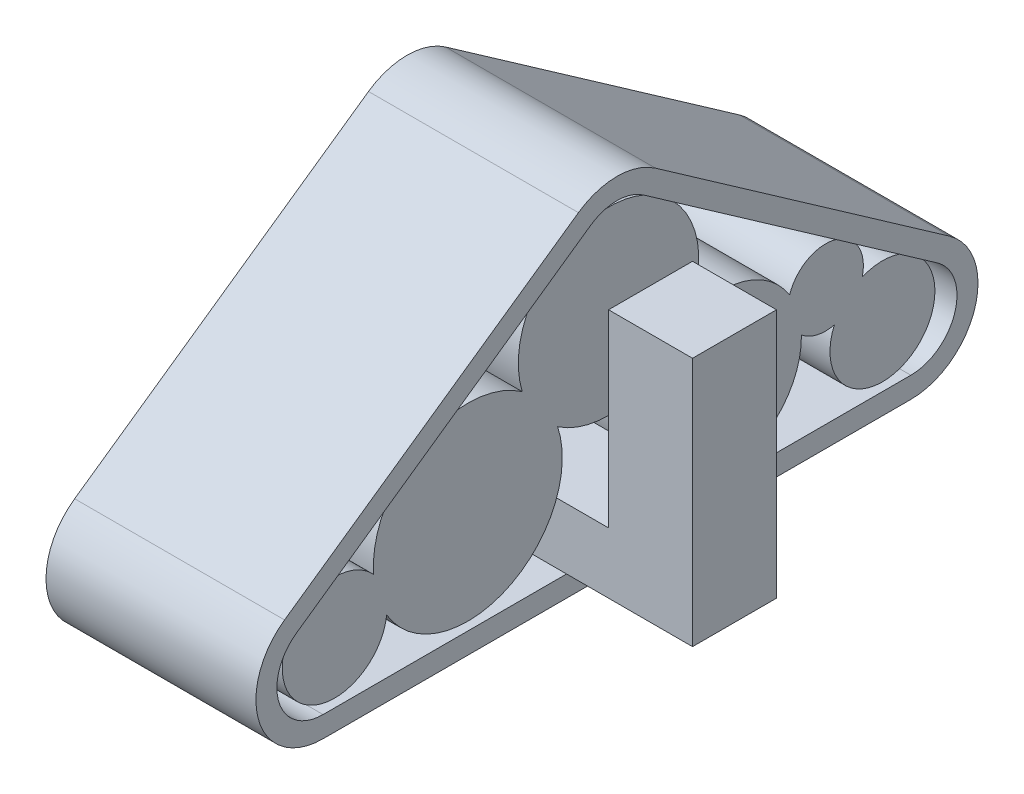
ISO-10303-21;
HEADER;
FILE_DESCRIPTION(('STEP AP214'),'2;1');
FILE_NAME('part.step','',(''),(''),'','','');
FILE_SCHEMA(('AUTOMOTIVE_DESIGN { 1 0 10303 214 1 1 1 1 }'));
ENDSEC;
DATA;
#1=APPLICATION_CONTEXT('core data for automotive mechanical design processes');
#2=APPLICATION_PROTOCOL_DEFINITION('international standard','automotive_design',2000,#1);
#3=PRODUCT_CONTEXT('',#1,'mechanical');
#4=PRODUCT('Part','Part','',(#3));
#5=PRODUCT_RELATED_PRODUCT_CATEGORY('part','',(#4));
#6=PRODUCT_DEFINITION_FORMATION('','',#4);
#7=PRODUCT_DEFINITION_CONTEXT('part definition',#1,'design');
#8=PRODUCT_DEFINITION('design','',#6,#7);
#9=PRODUCT_DEFINITION_SHAPE('','',#8);
#10=(LENGTH_UNIT() NAMED_UNIT(*) SI_UNIT(.MILLI.,.METRE.));
#11=(NAMED_UNIT(*) PLANE_ANGLE_UNIT() SI_UNIT($,.RADIAN.));
#12=(NAMED_UNIT(*) SI_UNIT($,.STERADIAN.) SOLID_ANGLE_UNIT());
#13=UNCERTAINTY_MEASURE_WITH_UNIT(LENGTH_MEASURE(1.E-05),#10,'distance_accuracy_value','');
#14=(GEOMETRIC_REPRESENTATION_CONTEXT(3) GLOBAL_UNCERTAINTY_ASSIGNED_CONTEXT((#13)) GLOBAL_UNIT_ASSIGNED_CONTEXT((#10,
#11,#12)) REPRESENTATION_CONTEXT('',''));
#15=CARTESIAN_POINT('',(0.,0.,0.));
#16=DIRECTION('',(0.,0.,1.));
#17=DIRECTION('',(1.,0.,0.));
#18=AXIS2_PLACEMENT_3D('',#15,#16,#17);
#19=CARTESIAN_POINT('',(0.18,0.,0.));
#20=DIRECTION('',(1.,0.,0.));
#21=DIRECTION('',(0.,0.,-1.));
#22=AXIS2_PLACEMENT_3D('',#19,#20,#21);
#23=PLANE('',#22);
#24=CARTESIAN_POINT('',(0.18,4.69767550434155,0.));
#25=DIRECTION('',(1.,0.,0.));
#26=DIRECTION('',(0.,0.,-1.));
#27=AXIS2_PLACEMENT_3D('',#24,#25,#26);
#28=CIRCLE('',#27,1.935);
#29=CARTESIAN_POINT('',(0.18,3.09967750269187,1.09115873580502));
#30=VERTEX_POINT('',#29);
#31=CARTESIAN_POINT('',(0.18,3.00557610584614,-0.938629120372617));
#32=VERTEX_POINT('',#31);
#33=EDGE_CURVE('E666',#30,#32,#28,.T.);
#34=ORIENTED_EDGE('',*,*,#33,.F.);
#35=CARTESIAN_POINT('',(0.18,2.475,3.01739937955405));
#36=DIRECTION('',(1.,0.,0.));
#37=DIRECTION('',(0.,0.,-1.));
#38=AXIS2_PLACEMENT_3D('',#35,#36,#37);
#39=CIRCLE('',#38,2.025);
#40=CARTESIAN_POINT('',(0.18,1.4358935825484,4.75546809315857));
#41=VERTEX_POINT('',#40);
#42=EDGE_CURVE('E692',#41,#30,#39,.T.);
#43=ORIENTED_EDGE('',*,*,#42,.F.);
#44=CARTESIAN_POINT('',(0.18,1.575,5.87183470168096));
#45=DIRECTION('',(1.,0.,0.));
#46=DIRECTION('',(0.,0.,-1.));
#47=AXIS2_PLACEMENT_3D('',#44,#45,#46);
#48=CIRCLE('',#47,1.125);
#49=CARTESIAN_POINT('',(0.18,2.32927088720677,5.03714887532932));
#50=VERTEX_POINT('',#49);
#51=EDGE_CURVE('E589',#50,#41,#48,.T.);
#52=ORIENTED_EDGE('',*,*,#51,.F.);
#53=CARTESIAN_POINT('',(0.18,4.12939973696195,1.84967230941297));
#54=VERTEX_POINT('',#53);
#55=EDGE_CURVE('E694',#54,#50,#39,.T.);
#56=ORIENTED_EDGE('',*,*,#55,.F.);
#57=CARTESIAN_POINT('',(0.18,3.68317129539575,-1.6477275897524));
#58=VERTEX_POINT('',#57);
#59=EDGE_CURVE('E737',#58,#54,#28,.T.);
#60=ORIENTED_EDGE('',*,*,#59,.F.);
#61=CARTESIAN_POINT('',(0.18,2.16,-2.42493361448615));
#62=DIRECTION('',(1.,0.,0.));
#63=DIRECTION('',(0.,0.,-1.));
#64=AXIS2_PLACEMENT_3D('',#61,#62,#63);
#65=CIRCLE('',#64,1.71);
#66=CARTESIAN_POINT('',(0.18,3.05678418171977,-3.88091374189765));
#67=VERTEX_POINT('',#66);
#68=EDGE_CURVE('E727',#67,#58,#65,.T.);
#69=ORIENTED_EDGE('',*,*,#68,.F.);
#70=CARTESIAN_POINT('',(0.18,2.81277967051205,-4.6532878730739));
#71=DIRECTION('',(1.,0.,0.));
#72=DIRECTION('',(0.,0.,-1.));
#73=AXIS2_PLACEMENT_3D('',#70,#71,#72);
#74=CIRCLE('',#73,0.809999999999999);
#75=CARTESIAN_POINT('',(0.18,2.61310658010924,-5.4382914762306));
#76=VERTEX_POINT('',#75);
#77=EDGE_CURVE('E732',#76,#67,#74,.T.);
#78=ORIENTED_EDGE('',*,*,#77,.F.);
#79=CARTESIAN_POINT('',(0.18,1.575,-5.87183470168096));
#80=DIRECTION('',(1.,0.,0.));
#81=DIRECTION('',(0.,0.,-1.));
#82=AXIS2_PLACEMENT_3D('',#79,#80,#81);
#83=CIRCLE('',#82,1.125);
#84=CARTESIAN_POINT('',(0.18,2.02474565764919,-4.84064420355479));
#85=VERTEX_POINT('',#84);
#86=EDGE_CURVE('E731',#76,#85,#83,.F.);
#87=ORIENTED_EDGE('',*,*,#86,.T.);
#88=CARTESIAN_POINT('',(0.18,2.19058581951665,-4.13466005682846));
#89=VERTEX_POINT('',#88);
#90=EDGE_CURVE('E726',#89,#85,#74,.T.);
#91=ORIENTED_EDGE('',*,*,#90,.F.);
#92=EDGE_CURVE('E723',#32,#89,#65,.T.);
#93=ORIENTED_EDGE('',*,*,#92,.F.);
#94=EDGE_LOOP('',(#34,#43,#52,#56,#60,#69,#78,#87,#91,#93));
#95=FACE_BOUND('',#94,.T.);
#96=ADVANCED_FACE('F570',(#95),#23,.F.);
#97=CARTESIAN_POINT('',(4.32,4.69767550434155,0.));
#98=DIRECTION('',(-1.,0.,0.));
#99=DIRECTION('',(0.,0.,1.));
#100=AXIS2_PLACEMENT_3D('',#97,#98,#99);
#101=CYLINDRICAL_SURFACE('',#100,1.935);
#102=DIRECTION('',(-1.,0.,0.));
#103=VECTOR('',#102,1.);
#104=CARTESIAN_POINT('',(4.32,3.09967750269187,1.09115873580502));
#105=LINE('',#104,#103);
#106=CARTESIAN_POINT('',(4.32,3.09967750269187,1.09115873580502));
#107=VERTEX_POINT('',#106);
#108=EDGE_CURVE('E703',#107,#30,#105,.T.);
#109=ORIENTED_EDGE('',*,*,#108,.T.);
#110=ORIENTED_EDGE('',*,*,#33,.T.);
#111=DIRECTION('',(-1.,0.,0.));
#112=VECTOR('',#111,1.);
#113=CARTESIAN_POINT('',(4.32,3.00557610584614,-0.938629120372617));
#114=LINE('',#113,#112);
#115=CARTESIAN_POINT('',(4.32,3.00557610584614,-0.938629120372617));
#116=VERTEX_POINT('',#115);
#117=EDGE_CURVE('E659',#116,#32,#114,.T.);
#118=ORIENTED_EDGE('',*,*,#117,.F.);
#119=CARTESIAN_POINT('',(4.32,4.69767550434155,0.));
#120=DIRECTION('',(1.,0.,0.));
#121=DIRECTION('',(0.,0.,-1.));
#122=AXIS2_PLACEMENT_3D('',#119,#120,#121);
#123=CIRCLE('',#122,1.935);
#124=EDGE_CURVE('E663',#107,#116,#123,.T.);
#125=ORIENTED_EDGE('',*,*,#124,.F.);
#126=EDGE_LOOP('',(#109,#110,#118,#125));
#127=FACE_BOUND('',#126,.T.);
#128=ADVANCED_FACE('F661',(#127),#101,.T.);
#129=CARTESIAN_POINT('',(4.32,0.,0.));
#130=DIRECTION('',(1.,0.,0.));
#131=DIRECTION('',(0.,0.,-1.));
#132=AXIS2_PLACEMENT_3D('',#129,#130,#131);
#133=PLANE('',#132);
#134=CARTESIAN_POINT('',(4.32,3.68317129539575,-1.6477275897524));
#135=VERTEX_POINT('',#134);
#136=CARTESIAN_POINT('',(4.32,4.12939973696195,1.84967230941297));
#137=VERTEX_POINT('',#136);
#138=EDGE_CURVE('E688',#135,#137,#123,.T.);
#139=ORIENTED_EDGE('',*,*,#138,.T.);
#140=CARTESIAN_POINT('',(4.32,2.475,3.01739937955405));
#141=DIRECTION('',(1.,0.,0.));
#142=DIRECTION('',(0.,0.,-1.));
#143=AXIS2_PLACEMENT_3D('',#140,#141,#142);
#144=CIRCLE('',#143,2.025);
#145=CARTESIAN_POINT('',(4.32,2.32927088720677,5.03714887532932));
#146=VERTEX_POINT('',#145);
#147=EDGE_CURVE('E699',#137,#146,#144,.T.);
#148=ORIENTED_EDGE('',*,*,#147,.T.);
#149=CARTESIAN_POINT('',(4.32,1.575,5.87183470168096));
#150=DIRECTION('',(1.,0.,0.));
#151=DIRECTION('',(0.,0.,-1.));
#152=AXIS2_PLACEMENT_3D('',#149,#150,#151);
#153=CIRCLE('',#152,1.125);
#154=CARTESIAN_POINT('',(4.32,1.4358935825484,4.75546809315857));
#155=VERTEX_POINT('',#154);
#156=EDGE_CURVE('E709',#146,#155,#153,.T.);
#157=ORIENTED_EDGE('',*,*,#156,.T.);
#158=EDGE_CURVE('E686',#155,#107,#144,.T.);
#159=ORIENTED_EDGE('',*,*,#158,.T.);
#160=ORIENTED_EDGE('',*,*,#124,.T.);
#161=CARTESIAN_POINT('',(4.32,2.16,-2.42493361448615));
#162=DIRECTION('',(1.,0.,0.));
#163=DIRECTION('',(0.,0.,-1.));
#164=AXIS2_PLACEMENT_3D('',#161,#162,#163);
#165=CIRCLE('',#164,1.71);
#166=CARTESIAN_POINT('',(4.32,2.19058581951665,-4.13466005682846));
#167=VERTEX_POINT('',#166);
#168=EDGE_CURVE('E673',#116,#167,#165,.T.);
#169=ORIENTED_EDGE('',*,*,#168,.T.);
#170=CARTESIAN_POINT('',(4.32,2.81277967051205,-4.6532878730739));
#171=DIRECTION('',(1.,0.,0.));
#172=DIRECTION('',(0.,0.,-1.));
#173=AXIS2_PLACEMENT_3D('',#170,#171,#172);
#174=CIRCLE('',#173,0.809999999999999);
#175=CARTESIAN_POINT('',(4.32,2.02474565764919,-4.84064420355479));
#176=VERTEX_POINT('',#175);
#177=EDGE_CURVE('E679',#167,#176,#174,.T.);
#178=ORIENTED_EDGE('',*,*,#177,.T.);
#179=CARTESIAN_POINT('',(4.32,1.575,-5.87183470168096));
#180=DIRECTION('',(1.,0.,0.));
#181=DIRECTION('',(0.,0.,-1.));
#182=AXIS2_PLACEMENT_3D('',#179,#180,#181);
#183=CIRCLE('',#182,1.125);
#184=CARTESIAN_POINT('',(4.32,2.61310658010924,-5.4382914762306));
#185=VERTEX_POINT('',#184);
#186=EDGE_CURVE('E718',#185,#176,#183,.F.);
#187=ORIENTED_EDGE('',*,*,#186,.F.);
#188=CARTESIAN_POINT('',(4.32,3.05678418171977,-3.88091374189765));
#189=VERTEX_POINT('',#188);
#190=EDGE_CURVE('E719',#185,#189,#174,.T.);
#191=ORIENTED_EDGE('',*,*,#190,.T.);
#192=EDGE_CURVE('E681',#189,#135,#165,.T.);
#193=ORIENTED_EDGE('',*,*,#192,.T.);
#194=EDGE_LOOP('',(#139,#148,#157,#159,#160,#169,#178,#187,#191,#193));
#195=FACE_BOUND('',#194,.T.);
#196=ADVANCED_FACE('F683',(#195),#133,.T.);
#197=DIRECTION('',(-1.,0.,0.));
#198=VECTOR('',#197,1.);
#199=CARTESIAN_POINT('',(4.32,3.68317129539575,-1.6477275897524));
#200=LINE('',#199,#198);
#201=EDGE_CURVE('E633',#135,#58,#200,.T.);
#202=ORIENTED_EDGE('',*,*,#201,.T.);
#203=ORIENTED_EDGE('',*,*,#59,.T.);
#204=DIRECTION('',(-1.,0.,0.));
#205=VECTOR('',#204,1.);
#206=CARTESIAN_POINT('',(4.32,4.12939973696195,1.84967230941297));
#207=LINE('',#206,#205);
#208=EDGE_CURVE('E706',#137,#54,#207,.T.);
#209=ORIENTED_EDGE('',*,*,#208,.F.);
#210=ORIENTED_EDGE('',*,*,#138,.F.);
#211=EDGE_LOOP('',(#202,#203,#209,#210));
#212=FACE_BOUND('',#211,.T.);
#213=ADVANCED_FACE('F781',(#212),#101,.T.);
#214=CARTESIAN_POINT('',(0.18,1.575,-5.87183470168096));
#215=DIRECTION('',(1.,0.,0.));
#216=DIRECTION('',(0.,0.,-1.));
#217=AXIS2_PLACEMENT_3D('',#214,#215,#216);
#218=CYLINDRICAL_SURFACE('',#217,1.125);
#219=DIRECTION('',(1.,0.,0.));
#220=VECTOR('',#219,1.);
#221=CARTESIAN_POINT('',(0.18,2.61310658010924,-5.4382914762306));
#222=LINE('',#221,#220);
#223=EDGE_CURVE('E617',#76,#185,#222,.T.);
#224=ORIENTED_EDGE('',*,*,#223,.T.);
#225=ORIENTED_EDGE('',*,*,#186,.T.);
#226=DIRECTION('',(1.,0.,0.));
#227=VECTOR('',#226,1.);
#228=CARTESIAN_POINT('',(0.18,2.02474565764919,-4.84064420355479));
#229=LINE('',#228,#227);
#230=EDGE_CURVE('E739',#85,#176,#229,.T.);
#231=ORIENTED_EDGE('',*,*,#230,.F.);
#232=ORIENTED_EDGE('',*,*,#86,.F.);
#233=EDGE_LOOP('',(#224,#225,#231,#232));
#234=FACE_BOUND('',#233,.T.);
#235=ADVANCED_FACE('F572',(#234),#218,.T.);
#236=CARTESIAN_POINT('',(0.18,2.81277967051205,-4.6532878730739));
#237=DIRECTION('',(1.,0.,0.));
#238=DIRECTION('',(0.,0.,-1.));
#239=AXIS2_PLACEMENT_3D('',#236,#237,#238);
#240=CYLINDRICAL_SURFACE('',#239,0.809999999999999);
#241=DIRECTION('',(1.,0.,0.));
#242=VECTOR('',#241,1.);
#243=CARTESIAN_POINT('',(0.18,3.05678418171977,-3.88091374189765));
#244=LINE('',#243,#242);
#245=EDGE_CURVE('E624',#67,#189,#244,.T.);
#246=ORIENTED_EDGE('',*,*,#245,.T.);
#247=ORIENTED_EDGE('',*,*,#190,.F.);
#248=ORIENTED_EDGE('',*,*,#223,.F.);
#249=ORIENTED_EDGE('',*,*,#77,.T.);
#250=EDGE_LOOP('',(#246,#247,#248,#249));
#251=FACE_BOUND('',#250,.T.);
#252=ADVANCED_FACE('F753',(#251),#240,.T.);
#253=ORIENTED_EDGE('',*,*,#230,.T.);
#254=ORIENTED_EDGE('',*,*,#177,.F.);
#255=DIRECTION('',(1.,0.,0.));
#256=VECTOR('',#255,1.);
#257=CARTESIAN_POINT('',(0.18,2.19058581951665,-4.13466005682846));
#258=LINE('',#257,#256);
#259=EDGE_CURVE('E574',#89,#167,#258,.T.);
#260=ORIENTED_EDGE('',*,*,#259,.F.);
#261=ORIENTED_EDGE('',*,*,#90,.T.);
#262=EDGE_LOOP('',(#253,#254,#260,#261));
#263=FACE_BOUND('',#262,.T.);
#264=ADVANCED_FACE('F772',(#263),#240,.T.);
#265=CARTESIAN_POINT('',(0.18,2.16,-2.42493361448615));
#266=DIRECTION('',(1.,0.,0.));
#267=DIRECTION('',(0.,0.,-1.));
#268=AXIS2_PLACEMENT_3D('',#265,#266,#267);
#269=CYLINDRICAL_SURFACE('',#268,1.71);
#270=ORIENTED_EDGE('',*,*,#259,.T.);
#271=ORIENTED_EDGE('',*,*,#168,.F.);
#272=ORIENTED_EDGE('',*,*,#117,.T.);
#273=ORIENTED_EDGE('',*,*,#92,.T.);
#274=EDGE_LOOP('',(#270,#271,#272,#273));
#275=FACE_BOUND('',#274,.T.);
#276=ADVANCED_FACE('F674',(#275),#269,.T.);
#277=ORIENTED_EDGE('',*,*,#201,.F.);
#278=ORIENTED_EDGE('',*,*,#192,.F.);
#279=ORIENTED_EDGE('',*,*,#245,.F.);
#280=ORIENTED_EDGE('',*,*,#68,.T.);
#281=EDGE_LOOP('',(#277,#278,#279,#280));
#282=FACE_BOUND('',#281,.T.);
#283=ADVANCED_FACE('F787',(#282),#269,.T.);
#284=CARTESIAN_POINT('',(0.18,1.575,5.87183470168096));
#285=DIRECTION('',(1.,0.,0.));
#286=DIRECTION('',(0.,0.,-1.));
#287=AXIS2_PLACEMENT_3D('',#284,#285,#286);
#288=CYLINDRICAL_SURFACE('',#287,1.125);
#289=DIRECTION('',(1.,0.,0.));
#290=VECTOR('',#289,1.);
#291=CARTESIAN_POINT('',(0.18,1.4358935825484,4.75546809315857));
#292=LINE('',#291,#290);
#293=EDGE_CURVE('E13',#41,#155,#292,.T.);
#294=ORIENTED_EDGE('',*,*,#293,.T.);
#295=ORIENTED_EDGE('',*,*,#156,.F.);
#296=DIRECTION('',(1.,0.,0.));
#297=VECTOR('',#296,1.);
#298=CARTESIAN_POINT('',(0.18,2.32927088720677,5.03714887532932));
#299=LINE('',#298,#297);
#300=EDGE_CURVE('E581',#50,#146,#299,.T.);
#301=ORIENTED_EDGE('',*,*,#300,.F.);
#302=ORIENTED_EDGE('',*,*,#51,.T.);
#303=EDGE_LOOP('',(#294,#295,#301,#302));
#304=FACE_BOUND('',#303,.T.);
#305=ADVANCED_FACE('F784',(#304),#288,.T.);
#306=CARTESIAN_POINT('',(4.32,2.475,3.01739937955405));
#307=DIRECTION('',(-1.,0.,0.));
#308=DIRECTION('',(0.,0.,1.));
#309=AXIS2_PLACEMENT_3D('',#306,#307,#308);
#310=CYLINDRICAL_SURFACE('',#309,2.025);
#311=ORIENTED_EDGE('',*,*,#208,.T.);
#312=ORIENTED_EDGE('',*,*,#55,.T.);
#313=ORIENTED_EDGE('',*,*,#300,.T.);
#314=ORIENTED_EDGE('',*,*,#147,.F.);
#315=EDGE_LOOP('',(#311,#312,#313,#314));
#316=FACE_BOUND('',#315,.T.);
#317=ADVANCED_FACE('F782',(#316),#310,.T.);
#318=ORIENTED_EDGE('',*,*,#158,.F.);
#319=ORIENTED_EDGE('',*,*,#293,.F.);
#320=ORIENTED_EDGE('',*,*,#42,.T.);
#321=ORIENTED_EDGE('',*,*,#108,.F.);
#322=EDGE_LOOP('',(#318,#319,#320,#321));
#323=FACE_BOUND('',#322,.T.);
#324=ADVANCED_FACE('F771',(#323),#310,.T.);
#325=CLOSED_SHELL('',(#96,#128,#196,#213,#235,#252,#264,#276,#283,#305,#317,#324));
#326=MANIFOLD_SOLID_BREP('B2',#325);
#327=CARTESIAN_POINT('',(0.,1.755,0.));
#328=DIRECTION('',(0.,1.,0.));
#329=DIRECTION('',(0.,0.,1.));
#330=AXIS2_PLACEMENT_3D('',#327,#328,#329);
#331=PLANE('',#330);
#332=DIRECTION('',(1.,0.,0.));
#333=VECTOR('',#332,1.);
#334=CARTESIAN_POINT('',(0.,1.755,1.08));
#335=LINE('',#334,#333);
#336=CARTESIAN_POINT('',(0.,1.755,1.08));
#337=VERTEX_POINT('',#336);
#338=CARTESIAN_POINT('',(5.4,1.755,1.08));
#339=VERTEX_POINT('',#338);
#340=EDGE_CURVE('E1191',#337,#339,#335,.T.);
#341=ORIENTED_EDGE('',*,*,#340,.T.);
#342=DIRECTION('',(0.,0.,1.));
#343=VECTOR('',#342,1.);
#344=CARTESIAN_POINT('',(5.4,1.755,-0.72));
#345=LINE('',#344,#343);
#346=CARTESIAN_POINT('',(5.4,1.755,-0.72));
#347=VERTEX_POINT('',#346);
#348=EDGE_CURVE('E1150',#347,#339,#345,.T.);
#349=ORIENTED_EDGE('',*,*,#348,.F.);
#350=DIRECTION('',(1.,0.,0.));
#351=VECTOR('',#350,1.);
#352=CARTESIAN_POINT('',(0.,1.755,-0.72));
#353=LINE('',#352,#351);
#354=CARTESIAN_POINT('',(0.,1.755,-0.72));
#355=VERTEX_POINT('',#354);
#356=EDGE_CURVE('E1181',#355,#347,#353,.T.);
#357=ORIENTED_EDGE('',*,*,#356,.F.);
#358=DIRECTION('',(0.,0.,1.));
#359=VECTOR('',#358,1.);
#360=CARTESIAN_POINT('',(0.,1.755,0.));
#361=LINE('',#360,#359);
#362=EDGE_CURVE('E1174',#355,#337,#361,.T.);
#363=ORIENTED_EDGE('',*,*,#362,.T.);
#364=EDGE_LOOP('',(#341,#349,#357,#363));
#365=FACE_BOUND('',#364,.T.);
#366=ADVANCED_FACE('F987',(#365),#331,.T.);
#367=CARTESIAN_POINT('',(4.5,0.450000000000002,0.));
#368=DIRECTION('',(0.,-1.,0.));
#369=DIRECTION('',(0.,0.,-1.));
#370=AXIS2_PLACEMENT_3D('',#367,#368,#369);
#371=PLANE('',#370);
#372=DIRECTION('',(1.,0.,0.));
#373=VECTOR('',#372,1.);
#374=CARTESIAN_POINT('',(0.,0.450000000000003,1.08));
#375=LINE('',#374,#373);
#376=CARTESIAN_POINT('',(0.,0.450000000000003,1.08));
#377=VERTEX_POINT('',#376);
#378=CARTESIAN_POINT('',(4.5,0.450000000000002,1.08));
#379=VERTEX_POINT('',#378);
#380=EDGE_CURVE('E1186',#377,#379,#375,.T.);
#381=ORIENTED_EDGE('',*,*,#380,.F.);
#382=DIRECTION('',(0.,0.,1.));
#383=VECTOR('',#382,1.);
#384=CARTESIAN_POINT('',(0.,0.450000000000002,0.));
#385=LINE('',#384,#383);
#386=CARTESIAN_POINT('',(0.,0.450000000000001,6.3));
#387=VERTEX_POINT('',#386);
#388=EDGE_CURVE('E1235',#377,#387,#385,.T.);
#389=ORIENTED_EDGE('',*,*,#388,.T.);
#390=DIRECTION('',(-1.,0.,0.));
#391=VECTOR('',#390,1.);
#392=CARTESIAN_POINT('',(4.5,0.450000000000001,6.3));
#393=LINE('',#392,#391);
#394=CARTESIAN_POINT('',(4.5,0.450000000000001,6.3));
#395=VERTEX_POINT('',#394);
#396=EDGE_CURVE('E1248',#395,#387,#393,.T.);
#397=ORIENTED_EDGE('',*,*,#396,.F.);
#398=DIRECTION('',(0.,0.,1.));
#399=VECTOR('',#398,1.);
#400=CARTESIAN_POINT('',(4.5,0.450000000000002,0.));
#401=LINE('',#400,#399);
#402=EDGE_CURVE('E1005',#379,#395,#401,.T.);
#403=ORIENTED_EDGE('',*,*,#402,.F.);
#404=EDGE_LOOP('',(#381,#389,#397,#403));
#405=FACE_BOUND('',#404,.T.);
#406=ADVANCED_FACE('F1358',(#405),#371,.F.);
#407=CARTESIAN_POINT('',(4.5,1.44,6.3));
#408=DIRECTION('',(-1.,0.,0.));
#409=DIRECTION('',(0.,0.,1.));
#410=AXIS2_PLACEMENT_3D('',#407,#408,#409);
#411=CYLINDRICAL_SURFACE('',#410,1.44);
#412=CARTESIAN_POINT('',(0.,1.44,6.3));
#413=DIRECTION('',(-1.,0.,0.));
#414=DIRECTION('',(0.,0.,1.));
#415=AXIS2_PLACEMENT_3D('',#412,#413,#414);
#416=CIRCLE('',#415,1.44);
#417=CARTESIAN_POINT('',(0.,0.,6.3));
#418=VERTEX_POINT('',#417);
#419=CARTESIAN_POINT('',(0.,2.61957894377615,7.1259500683455));
#420=VERTEX_POINT('',#419);
#421=EDGE_CURVE('E1261',#418,#420,#416,.T.);
#422=ORIENTED_EDGE('',*,*,#421,.F.);
#423=DIRECTION('',(-1.,0.,0.));
#424=VECTOR('',#423,1.);
#425=CARTESIAN_POINT('',(4.5,0.,6.3));
#426=LINE('',#425,#424);
#427=CARTESIAN_POINT('',(4.5,0.,6.3));
#428=VERTEX_POINT('',#427);
#429=EDGE_CURVE('E568',#428,#418,#426,.T.);
#430=ORIENTED_EDGE('',*,*,#429,.F.);
#431=CARTESIAN_POINT('',(4.5,1.44,6.3));
#432=DIRECTION('',(-1.,0.,0.));
#433=DIRECTION('',(0.,0.,1.));
#434=AXIS2_PLACEMENT_3D('',#431,#432,#433);
#435=CIRCLE('',#434,1.44);
#436=CARTESIAN_POINT('',(4.5,2.61957894377615,7.1259500683455));
#437=VERTEX_POINT('',#436);
#438=EDGE_CURVE('E1262',#428,#437,#435,.T.);
#439=ORIENTED_EDGE('',*,*,#438,.T.);
#440=DIRECTION('',(-1.,0.,0.));
#441=VECTOR('',#440,1.);
#442=CARTESIAN_POINT('',(4.5,2.61957894377615,7.1259500683455));
#443=LINE('',#442,#441);
#444=EDGE_CURVE('E991',#437,#420,#443,.T.);
#445=ORIENTED_EDGE('',*,*,#444,.T.);
#446=EDGE_LOOP('',(#422,#430,#439,#445));
#447=FACE_BOUND('',#446,.T.);
#448=ADVANCED_FACE('F989',(#447),#411,.T.);
#449=CARTESIAN_POINT('',(4.5,0.,5.4));
#450=DIRECTION('',(0.,-1.,0.));
#451=DIRECTION('',(0.,0.,-1.));
#452=AXIS2_PLACEMENT_3D('',#449,#450,#451);
#453=PLANE('',#452);
#454=DIRECTION('',(0.,0.,1.));
#455=VECTOR('',#454,1.);
#456=CARTESIAN_POINT('',(0.,0.,5.4));
#457=LINE('',#456,#455);
#458=CARTESIAN_POINT('',(0.,0.,-6.3));
#459=VERTEX_POINT('',#458);
#460=EDGE_CURVE('E1267',#459,#418,#457,.T.);
#461=ORIENTED_EDGE('',*,*,#460,.F.);
#462=DIRECTION('',(-1.,0.,0.));
#463=VECTOR('',#462,1.);
#464=CARTESIAN_POINT('',(4.5,0.,-6.3));
#465=LINE('',#464,#463);
#466=CARTESIAN_POINT('',(4.5,0.,-6.3));
#467=VERTEX_POINT('',#466);
#468=EDGE_CURVE('E997',#467,#459,#465,.T.);
#469=ORIENTED_EDGE('',*,*,#468,.F.);
#470=DIRECTION('',(0.,0.,-1.));
#471=VECTOR('',#470,1.);
#472=CARTESIAN_POINT('',(4.5,0.,-5.4));
#473=LINE('',#472,#471);
#474=EDGE_CURVE('E1282',#428,#467,#473,.T.);
#475=ORIENTED_EDGE('',*,*,#474,.F.);
#476=ORIENTED_EDGE('',*,*,#429,.T.);
#477=EDGE_LOOP('',(#461,#469,#475,#476));
#478=FACE_BOUND('',#477,.T.);
#479=ADVANCED_FACE('F1336',(#478),#453,.T.);
#480=CARTESIAN_POINT('',(4.5,1.44,-6.3));
#481=DIRECTION('',(-1.,0.,0.));
#482=DIRECTION('',(0.,0.,1.));
#483=AXIS2_PLACEMENT_3D('',#480,#481,#482);
#484=CYLINDRICAL_SURFACE('',#483,1.44);
#485=CARTESIAN_POINT('',(0.,1.44,-6.3));
#486=DIRECTION('',(-1.,0.,0.));
#487=DIRECTION('',(0.,0.,1.));
#488=AXIS2_PLACEMENT_3D('',#485,#486,#487);
#489=CIRCLE('',#488,1.44);
#490=CARTESIAN_POINT('',(0.,2.61957894377615,-7.1259500683455));
#491=VERTEX_POINT('',#490);
#492=EDGE_CURVE('E1300',#491,#459,#489,.T.);
#493=ORIENTED_EDGE('',*,*,#492,.F.);
#494=DIRECTION('',(-1.,0.,0.));
#495=VECTOR('',#494,1.);
#496=CARTESIAN_POINT('',(4.5,2.61957894377615,-7.1259500683455));
#497=LINE('',#496,#495);
#498=CARTESIAN_POINT('',(4.5,2.61957894377615,-7.1259500683455));
#499=VERTEX_POINT('',#498);
#500=EDGE_CURVE('E1310',#499,#491,#497,.T.);
#501=ORIENTED_EDGE('',*,*,#500,.F.);
#502=CARTESIAN_POINT('',(4.5,1.44,-6.3));
#503=DIRECTION('',(-1.,0.,0.));
#504=DIRECTION('',(0.,0.,1.));
#505=AXIS2_PLACEMENT_3D('',#502,#503,#504);
#506=CIRCLE('',#505,1.44);
#507=EDGE_CURVE('E1278',#499,#467,#506,.T.);
#508=ORIENTED_EDGE('',*,*,#507,.T.);
#509=ORIENTED_EDGE('',*,*,#468,.T.);
#510=EDGE_LOOP('',(#493,#501,#508,#509));
#511=FACE_BOUND('',#510,.T.);
#512=ADVANCED_FACE('F1338',(#511),#484,.T.);
#513=CARTESIAN_POINT('',(4.5,2.61957894377615,-7.1259500683455));
#514=DIRECTION('',(0.,-0.819152044288995,0.573576436351042));
#515=DIRECTION('',(0.,-0.573576436351042,-0.819152044288995));
#516=AXIS2_PLACEMENT_3D('',#513,#514,#515);
#517=PLANE('',#516);
#518=DIRECTION('',(0.,0.573576436351042,0.819152044288995));
#519=VECTOR('',#518,1.);
#520=CARTESIAN_POINT('',(0.,2.61957894377615,-7.1259500683455));
#521=LINE('',#520,#519);
#522=CARTESIAN_POINT('',(0.,7.03088643449728,-0.825950068345499));
#523=VERTEX_POINT('',#522);
#524=EDGE_CURVE('E1296',#491,#523,#521,.T.);
#525=ORIENTED_EDGE('',*,*,#524,.T.);
#526=DIRECTION('',(-1.,0.,0.));
#527=VECTOR('',#526,1.);
#528=CARTESIAN_POINT('',(4.5,7.03088643449728,-0.825950068345499));
#529=LINE('',#528,#527);
#530=CARTESIAN_POINT('',(4.5,7.03088643449728,-0.825950068345499));
#531=VERTEX_POINT('',#530);
#532=EDGE_CURVE('E1313',#531,#523,#529,.T.);
#533=ORIENTED_EDGE('',*,*,#532,.F.);
#534=DIRECTION('',(0.,0.573576436351042,0.819152044288995));
#535=VECTOR('',#534,1.);
#536=CARTESIAN_POINT('',(4.5,2.61957894377615,-7.1259500683455));
#537=LINE('',#536,#535);
#538=EDGE_CURVE('E1275',#499,#531,#537,.T.);
#539=ORIENTED_EDGE('',*,*,#538,.F.);
#540=ORIENTED_EDGE('',*,*,#500,.T.);
#541=EDGE_LOOP('',(#525,#533,#539,#540));
#542=FACE_BOUND('',#541,.T.);
#543=ADVANCED_FACE('F1348',(#542),#517,.F.);
#544=CARTESIAN_POINT('',(4.5,5.85130749072112,0.));
#545=DIRECTION('',(-1.,0.,0.));
#546=DIRECTION('',(0.,0.,1.));
#547=AXIS2_PLACEMENT_3D('',#544,#545,#546);
#548=CYLINDRICAL_SURFACE('',#547,1.44);
#549=CARTESIAN_POINT('',(0.,5.85130749072112,0.));
#550=DIRECTION('',(-1.,0.,0.));
#551=DIRECTION('',(0.,0.,1.));
#552=AXIS2_PLACEMENT_3D('',#549,#550,#551);
#553=CIRCLE('',#552,1.44);
#554=CARTESIAN_POINT('',(0.,7.03088643449728,0.825950068345499));
#555=VERTEX_POINT('',#554);
#556=EDGE_CURVE('E1292',#555,#523,#553,.T.);
#557=ORIENTED_EDGE('',*,*,#556,.F.);
#558=DIRECTION('',(-1.,0.,0.));
#559=VECTOR('',#558,1.);
#560=CARTESIAN_POINT('',(4.5,7.03088643449728,0.825950068345499));
#561=LINE('',#560,#559);
#562=CARTESIAN_POINT('',(4.5,7.03088643449728,0.825950068345499));
#563=VERTEX_POINT('',#562);
#564=EDGE_CURVE('E1315',#563,#555,#561,.T.);
#565=ORIENTED_EDGE('',*,*,#564,.F.);
#566=CARTESIAN_POINT('',(4.5,5.85130749072112,0.));
#567=DIRECTION('',(-1.,0.,0.));
#568=DIRECTION('',(0.,0.,1.));
#569=AXIS2_PLACEMENT_3D('',#566,#567,#568);
#570=CIRCLE('',#569,1.44);
#571=EDGE_CURVE('E1271',#563,#531,#570,.T.);
#572=ORIENTED_EDGE('',*,*,#571,.T.);
#573=ORIENTED_EDGE('',*,*,#532,.T.);
#574=EDGE_LOOP('',(#557,#565,#572,#573));
#575=FACE_BOUND('',#574,.T.);
#576=ADVANCED_FACE('F1346',(#575),#548,.T.);
#577=CARTESIAN_POINT('',(4.5,2.61957894377615,7.1259500683455));
#578=DIRECTION('',(0.,0.819152044288995,0.573576436351042));
#579=DIRECTION('',(0.,-0.573576436351042,0.819152044288995));
#580=AXIS2_PLACEMENT_3D('',#577,#578,#579);
#581=PLANE('',#580);
#582=DIRECTION('',(0.,0.573576436351042,-0.819152044288995));
#583=VECTOR('',#582,1.);
#584=CARTESIAN_POINT('',(0.,2.61957894377615,7.1259500683455));
#585=LINE('',#584,#583);
#586=EDGE_CURVE('E1288',#420,#555,#585,.T.);
#587=ORIENTED_EDGE('',*,*,#586,.F.);
#588=ORIENTED_EDGE('',*,*,#444,.F.);
#589=DIRECTION('',(0.,0.573576436351042,-0.819152044288995));
#590=VECTOR('',#589,1.);
#591=CARTESIAN_POINT('',(4.5,2.61957894377615,7.1259500683455));
#592=LINE('',#591,#590);
#593=EDGE_CURVE('E1266',#437,#563,#592,.T.);
#594=ORIENTED_EDGE('',*,*,#593,.T.);
#595=ORIENTED_EDGE('',*,*,#564,.T.);
#596=EDGE_LOOP('',(#587,#588,#594,#595));
#597=FACE_BOUND('',#596,.T.);
#598=ADVANCED_FACE('F1329',(#597),#581,.T.);
#599=CARTESIAN_POINT('',(4.5,1.44,6.3));
#600=DIRECTION('',(-1.,0.,0.));
#601=DIRECTION('',(0.,0.,1.));
#602=AXIS2_PLACEMENT_3D('',#599,#600,#601);
#603=PLANE('',#602);
#604=CARTESIAN_POINT('',(4.5,5.85130749072112,0.));
#605=DIRECTION('',(1.,0.,0.));
#606=DIRECTION('',(0.,0.,-1.));
#607=AXIS2_PLACEMENT_3D('',#604,#605,#606);
#608=CIRCLE('',#607,0.989999999999999);
#609=CARTESIAN_POINT('',(4.5,6.66226801456723,-0.56784067198753));
#610=VERTEX_POINT('',#609);
#611=CARTESIAN_POINT('',(4.5,6.66226801456723,0.56784067198753));
#612=VERTEX_POINT('',#611);
#613=EDGE_CURVE('E1201',#610,#612,#608,.T.);
#614=ORIENTED_EDGE('',*,*,#613,.F.);
#615=DIRECTION('',(0.,-0.573576436351042,-0.819152044288995));
#616=VECTOR('',#615,1.);
#617=CARTESIAN_POINT('',(4.5,4.7372467825162,-3.3170559074775));
#618=LINE('',#617,#616);
#619=CARTESIAN_POINT('',(4.5,2.25096052384611,-6.86784067198753));
#620=VERTEX_POINT('',#619);
#621=EDGE_CURVE('E1197',#610,#620,#618,.T.);
#622=ORIENTED_EDGE('',*,*,#621,.T.);
#623=CARTESIAN_POINT('',(4.5,1.44,-6.3));
#624=DIRECTION('',(1.,0.,0.));
#625=DIRECTION('',(0.,0.,-1.));
#626=AXIS2_PLACEMENT_3D('',#623,#624,#625);
#627=CIRCLE('',#626,0.989999999999999);
#628=CARTESIAN_POINT('',(4.5,0.450000000000003,-6.3));
#629=VERTEX_POINT('',#628);
#630=EDGE_CURVE('E1215',#620,#629,#627,.F.);
#631=ORIENTED_EDGE('',*,*,#630,.T.);
#632=CARTESIAN_POINT('',(4.5,0.450000000000002,-0.72));
#633=VERTEX_POINT('',#632);
#634=EDGE_CURVE('E1212',#629,#633,#401,.T.);
#635=ORIENTED_EDGE('',*,*,#634,.T.);
#636=EDGE_CURVE('E1216',#633,#379,#401,.T.);
#637=ORIENTED_EDGE('',*,*,#636,.T.);
#638=ORIENTED_EDGE('',*,*,#402,.T.);
#639=CARTESIAN_POINT('',(4.5,1.44,6.3));
#640=DIRECTION('',(1.,0.,0.));
#641=DIRECTION('',(0.,0.,-1.));
#642=AXIS2_PLACEMENT_3D('',#639,#640,#641);
#643=CIRCLE('',#642,0.990000000000001);
#644=CARTESIAN_POINT('',(4.5,2.25096052384611,6.86784067198753));
#645=VERTEX_POINT('',#644);
#646=EDGE_CURVE('E1208',#645,#395,#643,.T.);
#647=ORIENTED_EDGE('',*,*,#646,.F.);
#648=DIRECTION('',(0.,-0.573576436351042,0.819152044288995));
#649=VECTOR('',#648,1.);
#650=CARTESIAN_POINT('',(4.5,4.7372467825162,3.3170559074775));
#651=LINE('',#650,#649);
#652=EDGE_CURVE('E1205',#612,#645,#651,.T.);
#653=ORIENTED_EDGE('',*,*,#652,.F.);
#654=EDGE_LOOP('',(#614,#622,#631,#635,#637,#638,#647,#653));
#655=FACE_BOUND('',#654,.T.);
#656=ORIENTED_EDGE('',*,*,#438,.F.);
#657=ORIENTED_EDGE('',*,*,#474,.T.);
#658=ORIENTED_EDGE('',*,*,#507,.F.);
#659=ORIENTED_EDGE('',*,*,#538,.T.);
#660=ORIENTED_EDGE('',*,*,#571,.F.);
#661=ORIENTED_EDGE('',*,*,#593,.F.);
#662=EDGE_LOOP('',(#656,#657,#658,#659,#660,#661));
#663=FACE_BOUND('',#662,.T.);
#664=ADVANCED_FACE('F1342',(#655,#663),#603,.F.);
#665=CARTESIAN_POINT('',(0.,1.44,6.3));
#666=DIRECTION('',(-1.,0.,0.));
#667=DIRECTION('',(0.,0.,1.));
#668=AXIS2_PLACEMENT_3D('',#665,#666,#667);
#669=PLANE('',#668);
#670=DIRECTION('',(0.,-0.573576436351042,-0.819152044288995));
#671=VECTOR('',#670,1.);
#672=CARTESIAN_POINT('',(0.,4.7372467825162,-3.3170559074775));
#673=LINE('',#672,#671);
#674=CARTESIAN_POINT('',(0.,6.66226801456723,-0.56784067198753));
#675=VERTEX_POINT('',#674);
#676=CARTESIAN_POINT('',(0.,2.25096052384611,-6.86784067198753));
#677=VERTEX_POINT('',#676);
#678=EDGE_CURVE('E1184',#675,#677,#673,.T.);
#679=ORIENTED_EDGE('',*,*,#678,.F.);
#680=CARTESIAN_POINT('',(0.,5.85130749072112,0.));
#681=DIRECTION('',(1.,0.,0.));
#682=DIRECTION('',(0.,0.,-1.));
#683=AXIS2_PLACEMENT_3D('',#680,#681,#682);
#684=CIRCLE('',#683,0.989999999999999);
#685=CARTESIAN_POINT('',(0.,6.66226801456723,0.56784067198753));
#686=VERTEX_POINT('',#685);
#687=EDGE_CURVE('E1223',#675,#686,#684,.T.);
#688=ORIENTED_EDGE('',*,*,#687,.T.);
#689=DIRECTION('',(0.,-0.573576436351042,0.819152044288995));
#690=VECTOR('',#689,1.);
#691=CARTESIAN_POINT('',(0.,4.7372467825162,3.3170559074775));
#692=LINE('',#691,#690);
#693=CARTESIAN_POINT('',(0.,2.25096052384611,6.86784067198753));
#694=VERTEX_POINT('',#693);
#695=EDGE_CURVE('E1227',#686,#694,#692,.T.);
#696=ORIENTED_EDGE('',*,*,#695,.T.);
#697=CARTESIAN_POINT('',(0.,1.44,6.3));
#698=DIRECTION('',(1.,0.,0.));
#699=DIRECTION('',(0.,0.,-1.));
#700=AXIS2_PLACEMENT_3D('',#697,#698,#699);
#701=CIRCLE('',#700,0.990000000000001);
#702=EDGE_CURVE('E1231',#694,#387,#701,.T.);
#703=ORIENTED_EDGE('',*,*,#702,.T.);
#704=ORIENTED_EDGE('',*,*,#388,.F.);
#705=DIRECTION('',(0.,1.,0.));
#706=VECTOR('',#705,1.);
#707=CARTESIAN_POINT('',(0.,0.,1.08));
#708=LINE('',#707,#706);
#709=EDGE_CURVE('E1178',#377,#337,#708,.T.);
#710=ORIENTED_EDGE('',*,*,#709,.T.);
#711=ORIENTED_EDGE('',*,*,#362,.F.);
#712=DIRECTION('',(0.,1.,0.));
#713=VECTOR('',#712,1.);
#714=CARTESIAN_POINT('',(0.,0.,-0.72));
#715=LINE('',#714,#713);
#716=CARTESIAN_POINT('',(0.,0.450000000000002,-0.72));
#717=VERTEX_POINT('',#716);
#718=EDGE_CURVE('E1170',#717,#355,#715,.T.);
#719=ORIENTED_EDGE('',*,*,#718,.F.);
#720=CARTESIAN_POINT('',(0.,0.450000000000003,-6.3));
#721=VERTEX_POINT('',#720);
#722=EDGE_CURVE('E1236',#721,#717,#385,.T.);
#723=ORIENTED_EDGE('',*,*,#722,.F.);
#724=CARTESIAN_POINT('',(0.,1.44,-6.3));
#725=DIRECTION('',(1.,0.,0.));
#726=DIRECTION('',(0.,0.,-1.));
#727=AXIS2_PLACEMENT_3D('',#724,#725,#726);
#728=CIRCLE('',#727,0.989999999999999);
#729=EDGE_CURVE('E1202',#677,#721,#728,.F.);
#730=ORIENTED_EDGE('',*,*,#729,.F.);
#731=EDGE_LOOP('',(#679,#688,#696,#703,#704,#710,#711,#719,#723,#730));
#732=FACE_BOUND('',#731,.T.);
#733=ORIENTED_EDGE('',*,*,#421,.T.);
#734=ORIENTED_EDGE('',*,*,#586,.T.);
#735=ORIENTED_EDGE('',*,*,#556,.T.);
#736=ORIENTED_EDGE('',*,*,#524,.F.);
#737=ORIENTED_EDGE('',*,*,#492,.T.);
#738=ORIENTED_EDGE('',*,*,#460,.T.);
#739=EDGE_LOOP('',(#733,#734,#735,#736,#737,#738));
#740=FACE_BOUND('',#739,.T.);
#741=ADVANCED_FACE('F1331',(#732,#740),#669,.T.);
#742=CARTESIAN_POINT('',(4.5,4.7372467825162,-3.3170559074775));
#743=DIRECTION('',(0.,0.819152044288995,-0.573576436351042));
#744=DIRECTION('',(0.,0.573576436351042,0.819152044288995));
#745=AXIS2_PLACEMENT_3D('',#742,#743,#744);
#746=PLANE('',#745);
#747=ORIENTED_EDGE('',*,*,#678,.T.);
#748=DIRECTION('',(-1.,0.,0.));
#749=VECTOR('',#748,1.);
#750=CARTESIAN_POINT('',(4.5,2.25096052384611,-6.86784067198753));
#751=LINE('',#750,#749);
#752=EDGE_CURVE('E1220',#620,#677,#751,.T.);
#753=ORIENTED_EDGE('',*,*,#752,.F.);
#754=ORIENTED_EDGE('',*,*,#621,.F.);
#755=DIRECTION('',(-1.,0.,0.));
#756=VECTOR('',#755,1.);
#757=CARTESIAN_POINT('',(4.5,6.66226801456723,-0.56784067198753));
#758=LINE('',#757,#756);
#759=EDGE_CURVE('E1258',#610,#675,#758,.T.);
#760=ORIENTED_EDGE('',*,*,#759,.T.);
#761=EDGE_LOOP('',(#747,#753,#754,#760));
#762=FACE_BOUND('',#761,.T.);
#763=ADVANCED_FACE('F1389',(#762),#746,.F.);
#764=CARTESIAN_POINT('',(4.5,5.85130749072112,0.));
#765=DIRECTION('',(-1.,0.,0.));
#766=DIRECTION('',(0.,0.,1.));
#767=AXIS2_PLACEMENT_3D('',#764,#765,#766);
#768=CYLINDRICAL_SURFACE('',#767,0.989999999999999);
#769=ORIENTED_EDGE('',*,*,#687,.F.);
#770=ORIENTED_EDGE('',*,*,#759,.F.);
#771=ORIENTED_EDGE('',*,*,#613,.T.);
#772=DIRECTION('',(-1.,0.,0.));
#773=VECTOR('',#772,1.);
#774=CARTESIAN_POINT('',(4.5,6.66226801456723,0.56784067198753));
#775=LINE('',#774,#773);
#776=EDGE_CURVE('E1255',#612,#686,#775,.T.);
#777=ORIENTED_EDGE('',*,*,#776,.T.);
#778=EDGE_LOOP('',(#769,#770,#771,#777));
#779=FACE_BOUND('',#778,.T.);
#780=ADVANCED_FACE('F1385',(#779),#768,.F.);
#781=CARTESIAN_POINT('',(4.5,4.7372467825162,3.3170559074775));
#782=DIRECTION('',(0.,-0.819152044288995,-0.573576436351042));
#783=DIRECTION('',(0.,0.573576436351042,-0.819152044288995));
#784=AXIS2_PLACEMENT_3D('',#781,#782,#783);
#785=PLANE('',#784);
#786=ORIENTED_EDGE('',*,*,#695,.F.);
#787=ORIENTED_EDGE('',*,*,#776,.F.);
#788=ORIENTED_EDGE('',*,*,#652,.T.);
#789=DIRECTION('',(-1.,0.,0.));
#790=VECTOR('',#789,1.);
#791=CARTESIAN_POINT('',(4.5,2.25096052384611,6.86784067198753));
#792=LINE('',#791,#790);
#793=EDGE_CURVE('E1252',#645,#694,#792,.T.);
#794=ORIENTED_EDGE('',*,*,#793,.T.);
#795=EDGE_LOOP('',(#786,#787,#788,#794));
#796=FACE_BOUND('',#795,.T.);
#797=ADVANCED_FACE('F1381',(#796),#785,.T.);
#798=CARTESIAN_POINT('',(4.5,1.44,6.3));
#799=DIRECTION('',(-1.,0.,0.));
#800=DIRECTION('',(0.,0.,1.));
#801=AXIS2_PLACEMENT_3D('',#798,#799,#800);
#802=CYLINDRICAL_SURFACE('',#801,0.990000000000001);
#803=ORIENTED_EDGE('',*,*,#702,.F.);
#804=ORIENTED_EDGE('',*,*,#793,.F.);
#805=ORIENTED_EDGE('',*,*,#646,.T.);
#806=ORIENTED_EDGE('',*,*,#396,.T.);
#807=EDGE_LOOP('',(#803,#804,#805,#806));
#808=FACE_BOUND('',#807,.T.);
#809=ADVANCED_FACE('F1378',(#808),#802,.F.);
#810=ORIENTED_EDGE('',*,*,#722,.T.);
#811=DIRECTION('',(1.,0.,0.));
#812=VECTOR('',#811,1.);
#813=CARTESIAN_POINT('',(0.,0.450000000000004,-0.72));
#814=LINE('',#813,#812);
#815=EDGE_CURVE('E1013',#717,#633,#814,.T.);
#816=ORIENTED_EDGE('',*,*,#815,.T.);
#817=ORIENTED_EDGE('',*,*,#634,.F.);
#818=DIRECTION('',(-1.,0.,0.));
#819=VECTOR('',#818,1.);
#820=CARTESIAN_POINT('',(4.5,0.450000000000003,-6.3));
#821=LINE('',#820,#819);
#822=EDGE_CURVE('E1245',#629,#721,#821,.T.);
#823=ORIENTED_EDGE('',*,*,#822,.T.);
#824=EDGE_LOOP('',(#810,#816,#817,#823));
#825=FACE_BOUND('',#824,.T.);
#826=ADVANCED_FACE('F1365',(#825),#371,.F.);
#827=CARTESIAN_POINT('',(4.5,1.44,-6.3));
#828=DIRECTION('',(-1.,0.,0.));
#829=DIRECTION('',(0.,0.,1.));
#830=AXIS2_PLACEMENT_3D('',#827,#828,#829);
#831=CYLINDRICAL_SURFACE('',#830,0.989999999999999);
#832=ORIENTED_EDGE('',*,*,#729,.T.);
#833=ORIENTED_EDGE('',*,*,#822,.F.);
#834=ORIENTED_EDGE('',*,*,#630,.F.);
#835=ORIENTED_EDGE('',*,*,#752,.T.);
#836=EDGE_LOOP('',(#832,#833,#834,#835));
#837=FACE_BOUND('',#836,.T.);
#838=ADVANCED_FACE('F1373',(#837),#831,.F.);
#839=CARTESIAN_POINT('',(0.,0.450000000000004,0.));
#840=DIRECTION('',(0.,-1.,0.));
#841=DIRECTION('',(0.,0.,-1.));
#842=AXIS2_PLACEMENT_3D('',#839,#840,#841);
#843=PLANE('',#842);
#844=ORIENTED_EDGE('',*,*,#636,.F.);
#845=CARTESIAN_POINT('',(7.2,0.450000000000004,-0.72));
#846=VERTEX_POINT('',#845);
#847=EDGE_CURVE('E1185',#633,#846,#814,.T.);
#848=ORIENTED_EDGE('',*,*,#847,.T.);
#849=DIRECTION('',(0.,0.,-1.));
#850=VECTOR('',#849,1.);
#851=CARTESIAN_POINT('',(7.2,0.450000000000004,0.));
#852=LINE('',#851,#850);
#853=CARTESIAN_POINT('',(7.2,0.450000000000003,1.08));
#854=VERTEX_POINT('',#853);
#855=EDGE_CURVE('E1129',#854,#846,#852,.T.);
#856=ORIENTED_EDGE('',*,*,#855,.F.);
#857=EDGE_CURVE('E1190',#379,#854,#375,.T.);
#858=ORIENTED_EDGE('',*,*,#857,.F.);
#859=EDGE_LOOP('',(#844,#848,#856,#858));
#860=FACE_BOUND('',#859,.T.);
#861=ADVANCED_FACE('F1372',(#860),#843,.T.);
#862=CARTESIAN_POINT('',(0.,0.,-0.72));
#863=DIRECTION('',(0.,0.,-1.));
#864=DIRECTION('',(-1.,0.,0.));
#865=AXIS2_PLACEMENT_3D('',#862,#863,#864);
#866=PLANE('',#865);
#867=ORIENTED_EDGE('',*,*,#356,.T.);
#868=DIRECTION('',(0.,-1.,0.));
#869=VECTOR('',#868,1.);
#870=CARTESIAN_POINT('',(5.4,5.805,-0.72));
#871=LINE('',#870,#869);
#872=CARTESIAN_POINT('',(5.4,5.805,-0.72));
#873=VERTEX_POINT('',#872);
#874=EDGE_CURVE('E1134',#873,#347,#871,.T.);
#875=ORIENTED_EDGE('',*,*,#874,.F.);
#876=DIRECTION('',(-1.,0.,0.));
#877=VECTOR('',#876,1.);
#878=CARTESIAN_POINT('',(7.2,5.805,-0.72));
#879=LINE('',#878,#877);
#880=CARTESIAN_POINT('',(7.2,5.805,-0.72));
#881=VERTEX_POINT('',#880);
#882=EDGE_CURVE('E1137',#881,#873,#879,.T.);
#883=ORIENTED_EDGE('',*,*,#882,.F.);
#884=DIRECTION('',(0.,1.,0.));
#885=VECTOR('',#884,1.);
#886=CARTESIAN_POINT('',(7.2,0.,-0.72));
#887=LINE('',#886,#885);
#888=EDGE_CURVE('E1122',#846,#881,#887,.T.);
#889=ORIENTED_EDGE('',*,*,#888,.F.);
#890=ORIENTED_EDGE('',*,*,#847,.F.);
#891=ORIENTED_EDGE('',*,*,#815,.F.);
#892=ORIENTED_EDGE('',*,*,#718,.T.);
#893=EDGE_LOOP('',(#867,#875,#883,#889,#890,#891,#892));
#894=FACE_BOUND('',#893,.T.);
#895=ADVANCED_FACE('F1139',(#894),#866,.T.);
#896=CARTESIAN_POINT('',(0.,0.,1.08));
#897=DIRECTION('',(0.,0.,-1.));
#898=DIRECTION('',(0.,1.,0.));
#899=AXIS2_PLACEMENT_3D('',#896,#897,#898);
#900=PLANE('',#899);
#901=ORIENTED_EDGE('',*,*,#380,.T.);
#902=ORIENTED_EDGE('',*,*,#857,.T.);
#903=DIRECTION('',(0.,1.,0.));
#904=VECTOR('',#903,1.);
#905=CARTESIAN_POINT('',(7.2,0.,1.08));
#906=LINE('',#905,#904);
#907=CARTESIAN_POINT('',(7.2,5.805,1.08));
#908=VERTEX_POINT('',#907);
#909=EDGE_CURVE('E1133',#854,#908,#906,.T.);
#910=ORIENTED_EDGE('',*,*,#909,.T.);
#911=DIRECTION('',(1.,0.,0.));
#912=VECTOR('',#911,1.);
#913=CARTESIAN_POINT('',(7.2,5.805,1.08));
#914=LINE('',#913,#912);
#915=CARTESIAN_POINT('',(5.4,5.805,1.08));
#916=VERTEX_POINT('',#915);
#917=EDGE_CURVE('E1148',#916,#908,#914,.T.);
#918=ORIENTED_EDGE('',*,*,#917,.F.);
#919=DIRECTION('',(0.,-1.,0.));
#920=VECTOR('',#919,1.);
#921=CARTESIAN_POINT('',(5.4,5.805,1.08));
#922=LINE('',#921,#920);
#923=EDGE_CURVE('E1159',#916,#339,#922,.T.);
#924=ORIENTED_EDGE('',*,*,#923,.T.);
#925=ORIENTED_EDGE('',*,*,#340,.F.);
#926=ORIENTED_EDGE('',*,*,#709,.F.);
#927=EDGE_LOOP('',(#901,#902,#910,#918,#924,#925,#926));
#928=FACE_BOUND('',#927,.T.);
#929=ADVANCED_FACE('F1368',(#928),#900,.F.);
#930=CARTESIAN_POINT('',(7.2,0.,0.));
#931=DIRECTION('',(1.,0.,0.));
#932=DIRECTION('',(0.,0.,-1.));
#933=AXIS2_PLACEMENT_3D('',#930,#931,#932);
#934=PLANE('',#933);
#935=ORIENTED_EDGE('',*,*,#888,.T.);
#936=DIRECTION('',(0.,0.,-1.));
#937=VECTOR('',#936,1.);
#938=CARTESIAN_POINT('',(7.2,5.805,-0.72));
#939=LINE('',#938,#937);
#940=EDGE_CURVE('E1127',#908,#881,#939,.T.);
#941=ORIENTED_EDGE('',*,*,#940,.F.);
#942=ORIENTED_EDGE('',*,*,#909,.F.);
#943=ORIENTED_EDGE('',*,*,#855,.T.);
#944=EDGE_LOOP('',(#935,#941,#942,#943));
#945=FACE_BOUND('',#944,.T.);
#946=ADVANCED_FACE('F1124',(#945),#934,.T.);
#947=CARTESIAN_POINT('',(5.4,5.805,-0.72));
#948=DIRECTION('',(1.,0.,0.));
#949=DIRECTION('',(0.,0.,-1.));
#950=AXIS2_PLACEMENT_3D('',#947,#948,#949);
#951=PLANE('',#950);
#952=ORIENTED_EDGE('',*,*,#348,.T.);
#953=ORIENTED_EDGE('',*,*,#923,.F.);
#954=DIRECTION('',(0.,0.,1.));
#955=VECTOR('',#954,1.);
#956=CARTESIAN_POINT('',(5.4,5.805,-0.72));
#957=LINE('',#956,#955);
#958=EDGE_CURVE('E1143',#873,#916,#957,.T.);
#959=ORIENTED_EDGE('',*,*,#958,.F.);
#960=ORIENTED_EDGE('',*,*,#874,.T.);
#961=EDGE_LOOP('',(#952,#953,#959,#960));
#962=FACE_BOUND('',#961,.T.);
#963=ADVANCED_FACE('F1427',(#962),#951,.F.);
#964=CARTESIAN_POINT('',(0.,5.805,0.));
#965=DIRECTION('',(0.,-1.,0.));
#966=DIRECTION('',(0.,0.,-1.));
#967=AXIS2_PLACEMENT_3D('',#964,#965,#966);
#968=PLANE('',#967);
#969=ORIENTED_EDGE('',*,*,#940,.T.);
#970=ORIENTED_EDGE('',*,*,#882,.T.);
#971=ORIENTED_EDGE('',*,*,#958,.T.);
#972=ORIENTED_EDGE('',*,*,#917,.T.);
#973=EDGE_LOOP('',(#969,#970,#971,#972));
#974=FACE_BOUND('',#973,.T.);
#975=ADVANCED_FACE('F1146',(#974),#968,.F.);
#976=CLOSED_SHELL('',(#366,#406,#448,#479,#512,#543,#576,#598,#664,#741,#763,#780,#797,#809,
#826,#838,#861,#895,#929,#946,#963,#975));
#977=MANIFOLD_SOLID_BREP('B7',#976);
#978=ADVANCED_BREP_SHAPE_REPRESENTATION('',(#18,#326,#977),#14);
#979=SHAPE_DEFINITION_REPRESENTATION(#9,#978);
ENDSEC;
END-ISO-10303-21;
